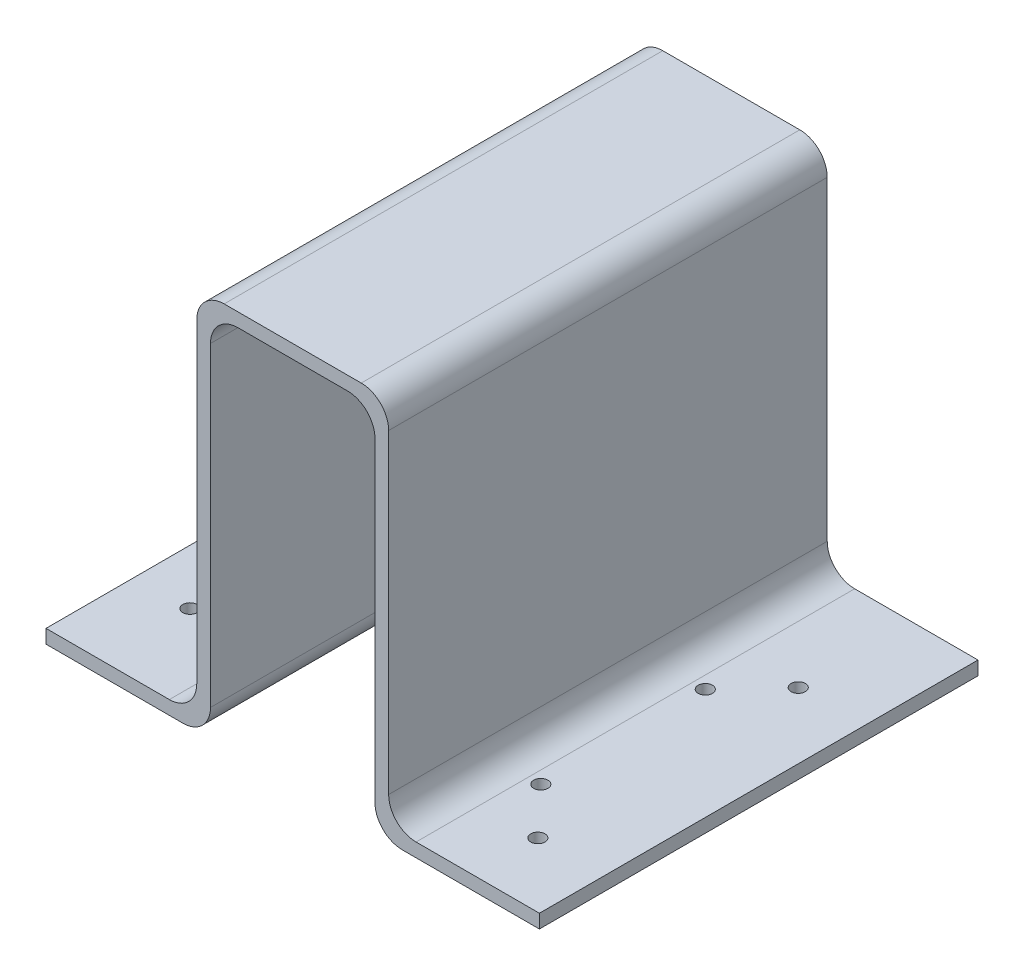
ISO-10303-21;
HEADER;
FILE_DESCRIPTION(('STEP AP214'),'2;1');
FILE_NAME('part.step','',(''),(''),'','','');
FILE_SCHEMA(('AUTOMOTIVE_DESIGN { 1 0 10303 214 1 1 1 1 }'));
ENDSEC;
DATA;
#1=APPLICATION_CONTEXT('core data for automotive mechanical design processes');
#2=APPLICATION_PROTOCOL_DEFINITION('international standard','automotive_design',2000,#1);
#3=PRODUCT_CONTEXT('',#1,'mechanical');
#4=PRODUCT('Part','Part','',(#3));
#5=PRODUCT_RELATED_PRODUCT_CATEGORY('part','',(#4));
#6=PRODUCT_DEFINITION_FORMATION('','',#4);
#7=PRODUCT_DEFINITION_CONTEXT('part definition',#1,'design');
#8=PRODUCT_DEFINITION('design','',#6,#7);
#9=PRODUCT_DEFINITION_SHAPE('','',#8);
#10=(LENGTH_UNIT() NAMED_UNIT(*) SI_UNIT(.MILLI.,.METRE.));
#11=(NAMED_UNIT(*) PLANE_ANGLE_UNIT() SI_UNIT($,.RADIAN.));
#12=(NAMED_UNIT(*) SI_UNIT($,.STERADIAN.) SOLID_ANGLE_UNIT());
#13=UNCERTAINTY_MEASURE_WITH_UNIT(LENGTH_MEASURE(1.E-05),#10,'distance_accuracy_value','');
#14=(GEOMETRIC_REPRESENTATION_CONTEXT(3) GLOBAL_UNCERTAINTY_ASSIGNED_CONTEXT((#13)) GLOBAL_UNIT_ASSIGNED_CONTEXT((#10,
#11,#12)) REPRESENTATION_CONTEXT('',''));
#15=CARTESIAN_POINT('',(0.,0.,0.));
#16=DIRECTION('',(0.,0.,1.));
#17=DIRECTION('',(1.,0.,0.));
#18=AXIS2_PLACEMENT_3D('',#15,#16,#17);
#19=CARTESIAN_POINT('',(0.,0.,203.2));
#20=DIRECTION('',(1.,0.,0.));
#21=DIRECTION('',(0.,0.,-1.));
#22=AXIS2_PLACEMENT_3D('',#19,#20,#21);
#23=PLANE('',#22);
#24=DIRECTION('',(0.,-1.,0.));
#25=VECTOR('',#24,1.);
#26=CARTESIAN_POINT('',(0.,0.,0.));
#27=LINE('',#26,#25);
#28=CARTESIAN_POINT('',(0.,6.35,0.));
#29=VERTEX_POINT('',#28);
#30=CARTESIAN_POINT('',(0.,0.,0.));
#31=VERTEX_POINT('',#30);
#32=EDGE_CURVE('E171',#29,#31,#27,.T.);
#33=ORIENTED_EDGE('',*,*,#32,.T.);
#34=DIRECTION('',(0.,0.,-1.));
#35=VECTOR('',#34,1.);
#36=CARTESIAN_POINT('',(0.,0.,203.2));
#37=LINE('',#36,#35);
#38=CARTESIAN_POINT('',(0.,0.,203.2));
#39=VERTEX_POINT('',#38);
#40=EDGE_CURVE('E11',#39,#31,#37,.T.);
#41=ORIENTED_EDGE('',*,*,#40,.F.);
#42=DIRECTION('',(0.,-1.,0.));
#43=VECTOR('',#42,1.);
#44=CARTESIAN_POINT('',(0.,0.,203.2));
#45=LINE('',#44,#43);
#46=CARTESIAN_POINT('',(0.,6.35,203.2));
#47=VERTEX_POINT('',#46);
#48=EDGE_CURVE('E228',#47,#39,#45,.T.);
#49=ORIENTED_EDGE('',*,*,#48,.F.);
#50=DIRECTION('',(0.,0.,-1.));
#51=VECTOR('',#50,1.);
#52=CARTESIAN_POINT('',(0.,6.35,203.2));
#53=LINE('',#52,#51);
#54=EDGE_CURVE('E184',#47,#29,#53,.T.);
#55=ORIENTED_EDGE('',*,*,#54,.T.);
#56=EDGE_LOOP('',(#33,#41,#49,#55));
#57=FACE_BOUND('',#56,.T.);
#58=ADVANCED_FACE('F31',(#57),#23,.F.);
#59=CARTESIAN_POINT('',(0.,0.,203.2));
#60=DIRECTION('',(0.,1.,0.));
#61=DIRECTION('',(0.,0.,1.));
#62=AXIS2_PLACEMENT_3D('',#59,#60,#61);
#63=PLANE('',#62);
#64=CARTESIAN_POINT('',(50.8,0.,139.7));
#65=DIRECTION('',(0.,1.,0.));
#66=DIRECTION('',(0.,0.,1.));
#67=AXIS2_PLACEMENT_3D('',#64,#65,#66);
#68=CIRCLE('',#67,3.302);
#69=CARTESIAN_POINT('',(50.8,0.,143.002));
#70=VERTEX_POINT('',#69);
#71=EDGE_CURVE('E616',#70,#70,#68,.T.);
#72=ORIENTED_EDGE('',*,*,#71,.T.);
#73=EDGE_LOOP('',(#72));
#74=FACE_BOUND('',#73,.T.);
#75=CARTESIAN_POINT('',(25.4,0.,161.925));
#76=DIRECTION('',(0.,1.,0.));
#77=DIRECTION('',(0.,0.,1.));
#78=AXIS2_PLACEMENT_3D('',#75,#76,#77);
#79=CIRCLE('',#78,3.302);
#80=CARTESIAN_POINT('',(25.4,0.,165.227));
#81=VERTEX_POINT('',#80);
#82=EDGE_CURVE('E621',#81,#81,#79,.T.);
#83=ORIENTED_EDGE('',*,*,#82,.T.);
#84=EDGE_LOOP('',(#83));
#85=FACE_BOUND('',#84,.T.);
#86=CARTESIAN_POINT('',(50.8,0.,63.5));
#87=DIRECTION('',(0.,1.,0.));
#88=DIRECTION('',(0.,0.,1.));
#89=AXIS2_PLACEMENT_3D('',#86,#87,#88);
#90=CIRCLE('',#89,3.302);
#91=CARTESIAN_POINT('',(50.8,0.,66.802));
#92=VERTEX_POINT('',#91);
#93=EDGE_CURVE('E627',#92,#92,#90,.T.);
#94=ORIENTED_EDGE('',*,*,#93,.T.);
#95=EDGE_LOOP('',(#94));
#96=FACE_BOUND('',#95,.T.);
#97=CARTESIAN_POINT('',(25.4,0.,41.275));
#98=DIRECTION('',(0.,1.,0.));
#99=DIRECTION('',(0.,0.,1.));
#100=AXIS2_PLACEMENT_3D('',#97,#98,#99);
#101=CIRCLE('',#100,3.302);
#102=CARTESIAN_POINT('',(25.4,0.,44.577));
#103=VERTEX_POINT('',#102);
#104=EDGE_CURVE('E185',#103,#103,#101,.T.);
#105=ORIENTED_EDGE('',*,*,#104,.T.);
#106=EDGE_LOOP('',(#105));
#107=FACE_BOUND('',#106,.T.);
#108=DIRECTION('',(1.,0.,0.));
#109=VECTOR('',#108,1.);
#110=CARTESIAN_POINT('',(0.,0.,0.));
#111=LINE('',#110,#109);
#112=CARTESIAN_POINT('',(63.4999999999999,0.,0.));
#113=VERTEX_POINT('',#112);
#114=EDGE_CURVE('E167',#31,#113,#111,.T.);
#115=ORIENTED_EDGE('',*,*,#114,.T.);
#116=DIRECTION('',(0.,0.,-1.));
#117=VECTOR('',#116,1.);
#118=CARTESIAN_POINT('',(63.4999999999999,0.,203.2));
#119=LINE('',#118,#117);
#120=CARTESIAN_POINT('',(63.4999999999999,0.,203.2));
#121=VERTEX_POINT('',#120);
#122=EDGE_CURVE('E38',#121,#113,#119,.T.);
#123=ORIENTED_EDGE('',*,*,#122,.F.);
#124=DIRECTION('',(1.,0.,0.));
#125=VECTOR('',#124,1.);
#126=CARTESIAN_POINT('',(0.,0.,203.2));
#127=LINE('',#126,#125);
#128=EDGE_CURVE('E180',#39,#121,#127,.T.);
#129=ORIENTED_EDGE('',*,*,#128,.F.);
#130=ORIENTED_EDGE('',*,*,#40,.T.);
#131=EDGE_LOOP('',(#115,#123,#129,#130));
#132=FACE_BOUND('',#131,.T.);
#133=ADVANCED_FACE('F179',(#74,#85,#96,#107,#132),#63,.F.);
#134=CARTESIAN_POINT('',(63.5,12.7,203.2));
#135=DIRECTION('',(0.,0.,-1.));
#136=DIRECTION('',(-1.,0.,0.));
#137=AXIS2_PLACEMENT_3D('',#134,#135,#136);
#138=CYLINDRICAL_SURFACE('',#137,12.7);
#139=CARTESIAN_POINT('',(63.5,12.7,0.));
#140=DIRECTION('',(0.,0.,1.));
#141=DIRECTION('',(1.,0.,0.));
#142=AXIS2_PLACEMENT_3D('',#139,#140,#141);
#143=CIRCLE('',#142,12.7);
#144=CARTESIAN_POINT('',(76.2,12.7000000000001,0.));
#145=VERTEX_POINT('',#144);
#146=EDGE_CURVE('E173',#113,#145,#143,.T.);
#147=ORIENTED_EDGE('',*,*,#146,.T.);
#148=DIRECTION('',(0.,0.,-1.));
#149=VECTOR('',#148,1.);
#150=CARTESIAN_POINT('',(76.2,12.7000000000001,203.2));
#151=LINE('',#150,#149);
#152=CARTESIAN_POINT('',(76.2,12.7000000000001,203.2));
#153=VERTEX_POINT('',#152);
#154=EDGE_CURVE('E314',#153,#145,#151,.T.);
#155=ORIENTED_EDGE('',*,*,#154,.F.);
#156=CARTESIAN_POINT('',(63.5,12.7,203.2));
#157=DIRECTION('',(0.,0.,1.));
#158=DIRECTION('',(1.,0.,0.));
#159=AXIS2_PLACEMENT_3D('',#156,#157,#158);
#160=CIRCLE('',#159,12.7);
#161=EDGE_CURVE('E231',#121,#153,#160,.T.);
#162=ORIENTED_EDGE('',*,*,#161,.F.);
#163=ORIENTED_EDGE('',*,*,#122,.T.);
#164=EDGE_LOOP('',(#147,#155,#162,#163));
#165=FACE_BOUND('',#164,.T.);
#166=ADVANCED_FACE('F318',(#165),#138,.T.);
#167=CARTESIAN_POINT('',(76.2,158.75,203.2));
#168=DIRECTION('',(-1.,0.,0.));
#169=DIRECTION('',(0.,-1.,0.));
#170=AXIS2_PLACEMENT_3D('',#167,#168,#169);
#171=PLANE('',#170);
#172=DIRECTION('',(0.,1.,0.));
#173=VECTOR('',#172,1.);
#174=CARTESIAN_POINT('',(76.2,158.75,0.));
#175=LINE('',#174,#173);
#176=CARTESIAN_POINT('',(76.2,158.75,0.));
#177=VERTEX_POINT('',#176);
#178=EDGE_CURVE('E193',#145,#177,#175,.T.);
#179=ORIENTED_EDGE('',*,*,#178,.T.);
#180=DIRECTION('',(0.,0.,-1.));
#181=VECTOR('',#180,1.);
#182=CARTESIAN_POINT('',(76.2,158.75,203.2));
#183=LINE('',#182,#181);
#184=CARTESIAN_POINT('',(76.2,158.75,203.2));
#185=VERTEX_POINT('',#184);
#186=EDGE_CURVE('E311',#185,#177,#183,.T.);
#187=ORIENTED_EDGE('',*,*,#186,.F.);
#188=DIRECTION('',(0.,1.,0.));
#189=VECTOR('',#188,1.);
#190=CARTESIAN_POINT('',(76.2,158.75,203.2));
#191=LINE('',#190,#189);
#192=EDGE_CURVE('E233',#153,#185,#191,.T.);
#193=ORIENTED_EDGE('',*,*,#192,.F.);
#194=ORIENTED_EDGE('',*,*,#154,.T.);
#195=EDGE_LOOP('',(#179,#187,#193,#194));
#196=FACE_BOUND('',#195,.T.);
#197=ADVANCED_FACE('F326',(#196),#171,.F.);
#198=CARTESIAN_POINT('',(88.9,158.75,203.2));
#199=DIRECTION('',(0.,0.,-1.));
#200=DIRECTION('',(-1.,0.,0.));
#201=AXIS2_PLACEMENT_3D('',#198,#199,#200);
#202=CYLINDRICAL_SURFACE('',#201,12.7);
#203=CARTESIAN_POINT('',(88.9,158.75,0.));
#204=DIRECTION('',(0.,0.,-1.));
#205=DIRECTION('',(1.,0.,0.));
#206=AXIS2_PLACEMENT_3D('',#203,#204,#205);
#207=CIRCLE('',#206,12.7);
#208=CARTESIAN_POINT('',(88.9000000000001,171.45,0.));
#209=VERTEX_POINT('',#208);
#210=EDGE_CURVE('E195',#177,#209,#207,.T.);
#211=ORIENTED_EDGE('',*,*,#210,.T.);
#212=DIRECTION('',(0.,0.,-1.));
#213=VECTOR('',#212,1.);
#214=CARTESIAN_POINT('',(88.9000000000001,171.45,203.2));
#215=LINE('',#214,#213);
#216=CARTESIAN_POINT('',(88.9000000000001,171.45,203.2));
#217=VERTEX_POINT('',#216);
#218=EDGE_CURVE('E308',#217,#209,#215,.T.);
#219=ORIENTED_EDGE('',*,*,#218,.F.);
#220=CARTESIAN_POINT('',(88.9,158.75,203.2));
#221=DIRECTION('',(0.,0.,-1.));
#222=DIRECTION('',(1.,0.,0.));
#223=AXIS2_PLACEMENT_3D('',#220,#221,#222);
#224=CIRCLE('',#223,12.7);
#225=EDGE_CURVE('E235',#185,#217,#224,.T.);
#226=ORIENTED_EDGE('',*,*,#225,.F.);
#227=ORIENTED_EDGE('',*,*,#186,.T.);
#228=EDGE_LOOP('',(#211,#219,#226,#227));
#229=FACE_BOUND('',#228,.T.);
#230=ADVANCED_FACE('F329',(#229),#202,.F.);
#231=CARTESIAN_POINT('',(139.7,171.45,203.2));
#232=DIRECTION('',(0.,1.,0.));
#233=DIRECTION('',(-1.,0.,0.));
#234=AXIS2_PLACEMENT_3D('',#231,#232,#233);
#235=PLANE('',#234);
#236=DIRECTION('',(1.,0.,0.));
#237=VECTOR('',#236,1.);
#238=CARTESIAN_POINT('',(139.7,171.45,0.));
#239=LINE('',#238,#237);
#240=CARTESIAN_POINT('',(139.7,171.45,0.));
#241=VERTEX_POINT('',#240);
#242=EDGE_CURVE('E197',#209,#241,#239,.T.);
#243=ORIENTED_EDGE('',*,*,#242,.T.);
#244=DIRECTION('',(0.,0.,-1.));
#245=VECTOR('',#244,1.);
#246=CARTESIAN_POINT('',(139.7,171.45,203.2));
#247=LINE('',#246,#245);
#248=CARTESIAN_POINT('',(139.7,171.45,203.2));
#249=VERTEX_POINT('',#248);
#250=EDGE_CURVE('E305',#249,#241,#247,.T.);
#251=ORIENTED_EDGE('',*,*,#250,.F.);
#252=DIRECTION('',(1.,0.,0.));
#253=VECTOR('',#252,1.);
#254=CARTESIAN_POINT('',(139.7,171.45,203.2));
#255=LINE('',#254,#253);
#256=EDGE_CURVE('E237',#217,#249,#255,.T.);
#257=ORIENTED_EDGE('',*,*,#256,.F.);
#258=ORIENTED_EDGE('',*,*,#218,.T.);
#259=EDGE_LOOP('',(#243,#251,#257,#258));
#260=FACE_BOUND('',#259,.T.);
#261=ADVANCED_FACE('F334',(#260),#235,.F.);
#262=CARTESIAN_POINT('',(139.7,158.75,203.2));
#263=DIRECTION('',(0.,0.,-1.));
#264=DIRECTION('',(-1.,0.,0.));
#265=AXIS2_PLACEMENT_3D('',#262,#263,#264);
#266=CYLINDRICAL_SURFACE('',#265,12.7);
#267=CARTESIAN_POINT('',(139.7,158.75,0.));
#268=DIRECTION('',(0.,0.,-1.));
#269=DIRECTION('',(-1.,0.,0.));
#270=AXIS2_PLACEMENT_3D('',#267,#268,#269);
#271=CIRCLE('',#270,12.7);
#272=CARTESIAN_POINT('',(152.4,158.75,0.));
#273=VERTEX_POINT('',#272);
#274=EDGE_CURVE('E199',#241,#273,#271,.T.);
#275=ORIENTED_EDGE('',*,*,#274,.T.);
#276=DIRECTION('',(0.,0.,-1.));
#277=VECTOR('',#276,1.);
#278=CARTESIAN_POINT('',(152.4,158.75,203.2));
#279=LINE('',#278,#277);
#280=CARTESIAN_POINT('',(152.4,158.75,203.2));
#281=VERTEX_POINT('',#280);
#282=EDGE_CURVE('E302',#281,#273,#279,.T.);
#283=ORIENTED_EDGE('',*,*,#282,.F.);
#284=CARTESIAN_POINT('',(139.7,158.75,203.2));
#285=DIRECTION('',(0.,0.,-1.));
#286=DIRECTION('',(-1.,0.,0.));
#287=AXIS2_PLACEMENT_3D('',#284,#285,#286);
#288=CIRCLE('',#287,12.7);
#289=EDGE_CURVE('E239',#249,#281,#288,.T.);
#290=ORIENTED_EDGE('',*,*,#289,.F.);
#291=ORIENTED_EDGE('',*,*,#250,.T.);
#292=EDGE_LOOP('',(#275,#283,#290,#291));
#293=FACE_BOUND('',#292,.T.);
#294=ADVANCED_FACE('F340',(#293),#266,.F.);
#295=CARTESIAN_POINT('',(152.4,12.7000000000001,203.2));
#296=DIRECTION('',(1.,0.,0.));
#297=DIRECTION('',(0.,0.,-1.));
#298=AXIS2_PLACEMENT_3D('',#295,#296,#297);
#299=PLANE('',#298);
#300=DIRECTION('',(0.,-1.,0.));
#301=VECTOR('',#300,1.);
#302=CARTESIAN_POINT('',(152.4,12.7000000000001,0.));
#303=LINE('',#302,#301);
#304=CARTESIAN_POINT('',(152.4,12.7000000000001,0.));
#305=VERTEX_POINT('',#304);
#306=EDGE_CURVE('E201',#273,#305,#303,.T.);
#307=ORIENTED_EDGE('',*,*,#306,.T.);
#308=DIRECTION('',(0.,0.,-1.));
#309=VECTOR('',#308,1.);
#310=CARTESIAN_POINT('',(152.4,12.7000000000001,203.2));
#311=LINE('',#310,#309);
#312=CARTESIAN_POINT('',(152.4,12.7000000000001,203.2));
#313=VERTEX_POINT('',#312);
#314=EDGE_CURVE('E299',#313,#305,#311,.T.);
#315=ORIENTED_EDGE('',*,*,#314,.F.);
#316=DIRECTION('',(0.,-1.,0.));
#317=VECTOR('',#316,1.);
#318=CARTESIAN_POINT('',(152.4,12.7000000000001,203.2));
#319=LINE('',#318,#317);
#320=EDGE_CURVE('E241',#281,#313,#319,.T.);
#321=ORIENTED_EDGE('',*,*,#320,.F.);
#322=ORIENTED_EDGE('',*,*,#282,.T.);
#323=EDGE_LOOP('',(#307,#315,#321,#322));
#324=FACE_BOUND('',#323,.T.);
#325=ADVANCED_FACE('F344',(#324),#299,.F.);
#326=CARTESIAN_POINT('',(165.1,12.7,203.2));
#327=DIRECTION('',(0.,0.,-1.));
#328=DIRECTION('',(-1.,0.,0.));
#329=AXIS2_PLACEMENT_3D('',#326,#327,#328);
#330=CYLINDRICAL_SURFACE('',#329,12.7);
#331=CARTESIAN_POINT('',(165.1,12.7,0.));
#332=DIRECTION('',(0.,0.,1.));
#333=DIRECTION('',(-1.,0.,0.));
#334=AXIS2_PLACEMENT_3D('',#331,#332,#333);
#335=CIRCLE('',#334,12.7);
#336=CARTESIAN_POINT('',(165.1,0.,0.));
#337=VERTEX_POINT('',#336);
#338=EDGE_CURVE('E203',#305,#337,#335,.T.);
#339=ORIENTED_EDGE('',*,*,#338,.T.);
#340=DIRECTION('',(0.,0.,-1.));
#341=VECTOR('',#340,1.);
#342=CARTESIAN_POINT('',(165.1,0.,203.2));
#343=LINE('',#342,#341);
#344=CARTESIAN_POINT('',(165.1,0.,203.2));
#345=VERTEX_POINT('',#344);
#346=EDGE_CURVE('E296',#345,#337,#343,.T.);
#347=ORIENTED_EDGE('',*,*,#346,.F.);
#348=CARTESIAN_POINT('',(165.1,12.7,203.2));
#349=DIRECTION('',(0.,0.,1.));
#350=DIRECTION('',(-1.,0.,0.));
#351=AXIS2_PLACEMENT_3D('',#348,#349,#350);
#352=CIRCLE('',#351,12.7);
#353=EDGE_CURVE('E243',#313,#345,#352,.T.);
#354=ORIENTED_EDGE('',*,*,#353,.F.);
#355=ORIENTED_EDGE('',*,*,#314,.T.);
#356=EDGE_LOOP('',(#339,#347,#354,#355));
#357=FACE_BOUND('',#356,.T.);
#358=ADVANCED_FACE('F349',(#357),#330,.T.);
#359=CARTESIAN_POINT('',(228.6,0.,203.2));
#360=DIRECTION('',(0.,1.,0.));
#361=DIRECTION('',(-1.,0.,0.));
#362=AXIS2_PLACEMENT_3D('',#359,#360,#361);
#363=PLANE('',#362);
#364=CARTESIAN_POINT('',(198.017767449923,0.,173.356336248613));
#365=DIRECTION('',(0.,1.,0.));
#366=DIRECTION('',(-1.,0.,0.));
#367=AXIS2_PLACEMENT_3D('',#364,#365,#366);
#368=CIRCLE('',#367,3.30200000000001);
#369=CARTESIAN_POINT('',(194.715767449923,0.,173.356336248613));
#370=VERTEX_POINT('',#369);
#371=EDGE_CURVE('E588',#370,#370,#368,.T.);
#372=ORIENTED_EDGE('',*,*,#371,.T.);
#373=EDGE_LOOP('',(#372));
#374=FACE_BOUND('',#373,.T.);
#375=CARTESIAN_POINT('',(198.017767449923,0.,52.7063362486132));
#376=DIRECTION('',(0.,1.,0.));
#377=DIRECTION('',(-1.,0.,0.));
#378=AXIS2_PLACEMENT_3D('',#375,#376,#377);
#379=CIRCLE('',#378,3.30200000000001);
#380=CARTESIAN_POINT('',(194.715767449923,0.,52.7063362486132));
#381=VERTEX_POINT('',#380);
#382=EDGE_CURVE('E598',#381,#381,#379,.T.);
#383=ORIENTED_EDGE('',*,*,#382,.T.);
#384=EDGE_LOOP('',(#383));
#385=FACE_BOUND('',#384,.T.);
#386=CARTESIAN_POINT('',(177.183969253211,0.,151.131336248613));
#387=DIRECTION('',(0.,1.,0.));
#388=DIRECTION('',(-1.,0.,0.));
#389=AXIS2_PLACEMENT_3D('',#386,#387,#388);
#390=CIRCLE('',#389,3.30200000000001);
#391=CARTESIAN_POINT('',(173.881969253211,0.,151.131336248613));
#392=VERTEX_POINT('',#391);
#393=EDGE_CURVE('E604',#392,#392,#390,.T.);
#394=ORIENTED_EDGE('',*,*,#393,.T.);
#395=EDGE_LOOP('',(#394));
#396=FACE_BOUND('',#395,.T.);
#397=CARTESIAN_POINT('',(177.183969253211,0.,74.9313362486132));
#398=DIRECTION('',(0.,1.,0.));
#399=DIRECTION('',(-1.,0.,0.));
#400=AXIS2_PLACEMENT_3D('',#397,#398,#399);
#401=CIRCLE('',#400,3.30200000000001);
#402=CARTESIAN_POINT('',(173.881969253211,0.,74.9313362486132));
#403=VERTEX_POINT('',#402);
#404=EDGE_CURVE('E610',#403,#403,#401,.T.);
#405=ORIENTED_EDGE('',*,*,#404,.T.);
#406=EDGE_LOOP('',(#405));
#407=FACE_BOUND('',#406,.T.);
#408=DIRECTION('',(1.,0.,0.));
#409=VECTOR('',#408,1.);
#410=CARTESIAN_POINT('',(228.6,0.,0.));
#411=LINE('',#410,#409);
#412=CARTESIAN_POINT('',(228.6,0.,0.));
#413=VERTEX_POINT('',#412);
#414=EDGE_CURVE('E205',#337,#413,#411,.T.);
#415=ORIENTED_EDGE('',*,*,#414,.T.);
#416=DIRECTION('',(0.,0.,-1.));
#417=VECTOR('',#416,1.);
#418=CARTESIAN_POINT('',(228.6,0.,203.2));
#419=LINE('',#418,#417);
#420=CARTESIAN_POINT('',(228.6,0.,203.2));
#421=VERTEX_POINT('',#420);
#422=EDGE_CURVE('E293',#421,#413,#419,.T.);
#423=ORIENTED_EDGE('',*,*,#422,.F.);
#424=DIRECTION('',(1.,0.,0.));
#425=VECTOR('',#424,1.);
#426=CARTESIAN_POINT('',(228.6,0.,203.2));
#427=LINE('',#426,#425);
#428=EDGE_CURVE('E245',#345,#421,#427,.T.);
#429=ORIENTED_EDGE('',*,*,#428,.F.);
#430=ORIENTED_EDGE('',*,*,#346,.T.);
#431=EDGE_LOOP('',(#415,#423,#429,#430));
#432=FACE_BOUND('',#431,.T.);
#433=ADVANCED_FACE('F355',(#374,#385,#396,#407,#432),#363,.F.);
#434=CARTESIAN_POINT('',(228.6,0.133258460616945,203.2));
#435=DIRECTION('',(-1.,0.,0.));
#436=DIRECTION('',(0.,0.,1.));
#437=AXIS2_PLACEMENT_3D('',#434,#435,#436);
#438=PLANE('',#437);
#439=DIRECTION('',(0.,1.,0.));
#440=VECTOR('',#439,1.);
#441=CARTESIAN_POINT('',(228.6,0.133258460616945,0.));
#442=LINE('',#441,#440);
#443=CARTESIAN_POINT('',(228.6,6.35,0.));
#444=VERTEX_POINT('',#443);
#445=EDGE_CURVE('E208',#413,#444,#442,.T.);
#446=ORIENTED_EDGE('',*,*,#445,.T.);
#447=DIRECTION('',(0.,0.,-1.));
#448=VECTOR('',#447,1.);
#449=CARTESIAN_POINT('',(228.6,6.35,203.2));
#450=LINE('',#449,#448);
#451=CARTESIAN_POINT('',(228.6,6.35,203.2));
#452=VERTEX_POINT('',#451);
#453=EDGE_CURVE('E290',#452,#444,#450,.T.);
#454=ORIENTED_EDGE('',*,*,#453,.F.);
#455=DIRECTION('',(0.,1.,0.));
#456=VECTOR('',#455,1.);
#457=CARTESIAN_POINT('',(228.6,0.,203.2));
#458=LINE('',#457,#456);
#459=EDGE_CURVE('E247',#421,#452,#458,.T.);
#460=ORIENTED_EDGE('',*,*,#459,.F.);
#461=ORIENTED_EDGE('',*,*,#422,.T.);
#462=EDGE_LOOP('',(#446,#454,#460,#461));
#463=FACE_BOUND('',#462,.T.);
#464=ADVANCED_FACE('F358',(#463),#438,.F.);
#465=CARTESIAN_POINT('',(228.6,6.35,203.2));
#466=DIRECTION('',(0.,-1.,0.));
#467=DIRECTION('',(1.,0.,0.));
#468=AXIS2_PLACEMENT_3D('',#465,#466,#467);
#469=PLANE('',#468);
#470=CARTESIAN_POINT('',(198.017767449923,6.35,173.356336248613));
#471=DIRECTION('',(0.,1.,0.));
#472=DIRECTION('',(-1.,0.,0.));
#473=AXIS2_PLACEMENT_3D('',#470,#471,#472);
#474=CIRCLE('',#473,3.30200000000001);
#475=CARTESIAN_POINT('',(194.715767449923,6.34999999999999,173.356336248613));
#476=VERTEX_POINT('',#475);
#477=EDGE_CURVE('E591',#476,#476,#474,.T.);
#478=ORIENTED_EDGE('',*,*,#477,.F.);
#479=EDGE_LOOP('',(#478));
#480=FACE_BOUND('',#479,.T.);
#481=CARTESIAN_POINT('',(198.017767449923,6.35,52.7063362486132));
#482=DIRECTION('',(0.,1.,0.));
#483=DIRECTION('',(-1.,0.,0.));
#484=AXIS2_PLACEMENT_3D('',#481,#482,#483);
#485=CIRCLE('',#484,3.30200000000001);
#486=CARTESIAN_POINT('',(194.715767449923,6.34999999999999,52.7063362486132));
#487=VERTEX_POINT('',#486);
#488=EDGE_CURVE('E593',#487,#487,#485,.T.);
#489=ORIENTED_EDGE('',*,*,#488,.F.);
#490=EDGE_LOOP('',(#489));
#491=FACE_BOUND('',#490,.T.);
#492=CARTESIAN_POINT('',(177.183969253211,6.34999999999999,151.131336248613));
#493=DIRECTION('',(0.,1.,0.));
#494=DIRECTION('',(-1.,0.,0.));
#495=AXIS2_PLACEMENT_3D('',#492,#493,#494);
#496=CIRCLE('',#495,3.30200000000001);
#497=CARTESIAN_POINT('',(173.881969253211,6.34999999999999,151.131336248613));
#498=VERTEX_POINT('',#497);
#499=EDGE_CURVE('E601',#498,#498,#496,.T.);
#500=ORIENTED_EDGE('',*,*,#499,.F.);
#501=EDGE_LOOP('',(#500));
#502=FACE_BOUND('',#501,.T.);
#503=CARTESIAN_POINT('',(177.183969253211,6.34999999999999,74.9313362486132));
#504=DIRECTION('',(0.,1.,0.));
#505=DIRECTION('',(-1.,0.,0.));
#506=AXIS2_PLACEMENT_3D('',#503,#504,#505);
#507=CIRCLE('',#506,3.30200000000001);
#508=CARTESIAN_POINT('',(173.881969253211,6.34999999999999,74.9313362486132));
#509=VERTEX_POINT('',#508);
#510=EDGE_CURVE('E607',#509,#509,#507,.T.);
#511=ORIENTED_EDGE('',*,*,#510,.F.);
#512=EDGE_LOOP('',(#511));
#513=FACE_BOUND('',#512,.T.);
#514=DIRECTION('',(-1.,0.,0.));
#515=VECTOR('',#514,1.);
#516=CARTESIAN_POINT('',(228.6,6.35,0.));
#517=LINE('',#516,#515);
#518=CARTESIAN_POINT('',(171.45,6.34999999999999,0.));
#519=VERTEX_POINT('',#518);
#520=EDGE_CURVE('E210',#444,#519,#517,.T.);
#521=ORIENTED_EDGE('',*,*,#520,.T.);
#522=DIRECTION('',(0.,0.,-1.));
#523=VECTOR('',#522,1.);
#524=CARTESIAN_POINT('',(171.45,6.34999999999999,203.2));
#525=LINE('',#524,#523);
#526=CARTESIAN_POINT('',(171.45,6.34999999999999,203.2));
#527=VERTEX_POINT('',#526);
#528=EDGE_CURVE('E287',#527,#519,#525,.T.);
#529=ORIENTED_EDGE('',*,*,#528,.F.);
#530=DIRECTION('',(-1.,0.,0.));
#531=VECTOR('',#530,1.);
#532=CARTESIAN_POINT('',(228.6,6.35,203.2));
#533=LINE('',#532,#531);
#534=EDGE_CURVE('E249',#452,#527,#533,.T.);
#535=ORIENTED_EDGE('',*,*,#534,.F.);
#536=ORIENTED_EDGE('',*,*,#453,.T.);
#537=EDGE_LOOP('',(#521,#529,#535,#536));
#538=FACE_BOUND('',#537,.T.);
#539=ADVANCED_FACE('F363',(#480,#491,#502,#513,#538),#469,.F.);
#540=CARTESIAN_POINT('',(171.45,19.05,203.2));
#541=DIRECTION('',(0.,0.,-1.));
#542=DIRECTION('',(-1.,0.,0.));
#543=AXIS2_PLACEMENT_3D('',#540,#541,#542);
#544=CYLINDRICAL_SURFACE('',#543,12.7);
#545=CARTESIAN_POINT('',(171.45,19.05,0.));
#546=DIRECTION('',(0.,0.,-1.));
#547=DIRECTION('',(1.,0.,0.));
#548=AXIS2_PLACEMENT_3D('',#545,#546,#547);
#549=CIRCLE('',#548,12.7);
#550=CARTESIAN_POINT('',(158.75,19.05,0.));
#551=VERTEX_POINT('',#550);
#552=EDGE_CURVE('E212',#519,#551,#549,.T.);
#553=ORIENTED_EDGE('',*,*,#552,.T.);
#554=DIRECTION('',(0.,0.,-1.));
#555=VECTOR('',#554,1.);
#556=CARTESIAN_POINT('',(158.75,19.05,203.2));
#557=LINE('',#556,#555);
#558=CARTESIAN_POINT('',(158.75,19.05,203.2));
#559=VERTEX_POINT('',#558);
#560=EDGE_CURVE('E284',#559,#551,#557,.T.);
#561=ORIENTED_EDGE('',*,*,#560,.F.);
#562=CARTESIAN_POINT('',(171.45,19.05,203.2));
#563=DIRECTION('',(0.,0.,-1.));
#564=DIRECTION('',(1.,0.,0.));
#565=AXIS2_PLACEMENT_3D('',#562,#563,#564);
#566=CIRCLE('',#565,12.7);
#567=EDGE_CURVE('E251',#527,#559,#566,.T.);
#568=ORIENTED_EDGE('',*,*,#567,.F.);
#569=ORIENTED_EDGE('',*,*,#528,.T.);
#570=EDGE_LOOP('',(#553,#561,#568,#569));
#571=FACE_BOUND('',#570,.T.);
#572=ADVANCED_FACE('F369',(#571),#544,.F.);
#573=CARTESIAN_POINT('',(158.75,165.1,203.2));
#574=DIRECTION('',(-1.,0.,0.));
#575=DIRECTION('',(0.,-1.,0.));
#576=AXIS2_PLACEMENT_3D('',#573,#574,#575);
#577=PLANE('',#576);
#578=DIRECTION('',(0.,1.,0.));
#579=VECTOR('',#578,1.);
#580=CARTESIAN_POINT('',(158.75,165.1,0.));
#581=LINE('',#580,#579);
#582=CARTESIAN_POINT('',(158.75,165.1,0.));
#583=VERTEX_POINT('',#582);
#584=EDGE_CURVE('E214',#551,#583,#581,.T.);
#585=ORIENTED_EDGE('',*,*,#584,.T.);
#586=DIRECTION('',(0.,0.,-1.));
#587=VECTOR('',#586,1.);
#588=CARTESIAN_POINT('',(158.75,165.1,203.2));
#589=LINE('',#588,#587);
#590=CARTESIAN_POINT('',(158.75,165.1,203.2));
#591=VERTEX_POINT('',#590);
#592=EDGE_CURVE('E281',#591,#583,#589,.T.);
#593=ORIENTED_EDGE('',*,*,#592,.F.);
#594=DIRECTION('',(0.,1.,0.));
#595=VECTOR('',#594,1.);
#596=CARTESIAN_POINT('',(158.75,165.1,203.2));
#597=LINE('',#596,#595);
#598=EDGE_CURVE('E253',#559,#591,#597,.T.);
#599=ORIENTED_EDGE('',*,*,#598,.F.);
#600=ORIENTED_EDGE('',*,*,#560,.T.);
#601=EDGE_LOOP('',(#585,#593,#599,#600));
#602=FACE_BOUND('',#601,.T.);
#603=ADVANCED_FACE('F373',(#602),#577,.F.);
#604=CARTESIAN_POINT('',(146.05,165.1,203.2));
#605=DIRECTION('',(0.,0.,-1.));
#606=DIRECTION('',(-1.,0.,0.));
#607=AXIS2_PLACEMENT_3D('',#604,#605,#606);
#608=CYLINDRICAL_SURFACE('',#607,12.7);
#609=CARTESIAN_POINT('',(146.05,165.1,0.));
#610=DIRECTION('',(0.,0.,1.));
#611=DIRECTION('',(1.,0.,0.));
#612=AXIS2_PLACEMENT_3D('',#609,#610,#611);
#613=CIRCLE('',#612,12.7);
#614=CARTESIAN_POINT('',(146.05,177.8,0.));
#615=VERTEX_POINT('',#614);
#616=EDGE_CURVE('E216',#583,#615,#613,.T.);
#617=ORIENTED_EDGE('',*,*,#616,.T.);
#618=DIRECTION('',(0.,0.,-1.));
#619=VECTOR('',#618,1.);
#620=CARTESIAN_POINT('',(146.05,177.8,203.2));
#621=LINE('',#620,#619);
#622=CARTESIAN_POINT('',(146.05,177.8,203.2));
#623=VERTEX_POINT('',#622);
#624=EDGE_CURVE('E278',#623,#615,#621,.T.);
#625=ORIENTED_EDGE('',*,*,#624,.F.);
#626=CARTESIAN_POINT('',(146.05,165.1,203.2));
#627=DIRECTION('',(0.,0.,1.));
#628=DIRECTION('',(1.,0.,0.));
#629=AXIS2_PLACEMENT_3D('',#626,#627,#628);
#630=CIRCLE('',#629,12.7);
#631=EDGE_CURVE('E255',#591,#623,#630,.T.);
#632=ORIENTED_EDGE('',*,*,#631,.F.);
#633=ORIENTED_EDGE('',*,*,#592,.T.);
#634=EDGE_LOOP('',(#617,#625,#632,#633));
#635=FACE_BOUND('',#634,.T.);
#636=ADVANCED_FACE('F378',(#635),#608,.T.);
#637=CARTESIAN_POINT('',(82.5500000000001,177.8,203.2));
#638=DIRECTION('',(0.,-1.,0.));
#639=DIRECTION('',(0.,0.,-1.));
#640=AXIS2_PLACEMENT_3D('',#637,#638,#639);
#641=PLANE('',#640);
#642=DIRECTION('',(-1.,0.,0.));
#643=VECTOR('',#642,1.);
#644=CARTESIAN_POINT('',(82.5500000000001,177.8,0.));
#645=LINE('',#644,#643);
#646=CARTESIAN_POINT('',(82.5500000000001,177.8,0.));
#647=VERTEX_POINT('',#646);
#648=EDGE_CURVE('E218',#615,#647,#645,.T.);
#649=ORIENTED_EDGE('',*,*,#648,.T.);
#650=DIRECTION('',(0.,0.,-1.));
#651=VECTOR('',#650,1.);
#652=CARTESIAN_POINT('',(82.5500000000001,177.8,203.2));
#653=LINE('',#652,#651);
#654=CARTESIAN_POINT('',(82.5500000000001,177.8,203.2));
#655=VERTEX_POINT('',#654);
#656=EDGE_CURVE('E275',#655,#647,#653,.T.);
#657=ORIENTED_EDGE('',*,*,#656,.F.);
#658=DIRECTION('',(-1.,0.,0.));
#659=VECTOR('',#658,1.);
#660=CARTESIAN_POINT('',(82.5500000000001,177.8,203.2));
#661=LINE('',#660,#659);
#662=EDGE_CURVE('E257',#623,#655,#661,.T.);
#663=ORIENTED_EDGE('',*,*,#662,.F.);
#664=ORIENTED_EDGE('',*,*,#624,.T.);
#665=EDGE_LOOP('',(#649,#657,#663,#664));
#666=FACE_BOUND('',#665,.T.);
#667=ADVANCED_FACE('F384',(#666),#641,.F.);
#668=CARTESIAN_POINT('',(82.55,165.1,203.2));
#669=DIRECTION('',(0.,0.,-1.));
#670=DIRECTION('',(-1.,0.,0.));
#671=AXIS2_PLACEMENT_3D('',#668,#669,#670);
#672=CYLINDRICAL_SURFACE('',#671,12.7);
#673=CARTESIAN_POINT('',(82.55,165.1,0.));
#674=DIRECTION('',(0.,0.,1.));
#675=DIRECTION('',(-1.,0.,0.));
#676=AXIS2_PLACEMENT_3D('',#673,#674,#675);
#677=CIRCLE('',#676,12.7);
#678=CARTESIAN_POINT('',(69.85,165.1,0.));
#679=VERTEX_POINT('',#678);
#680=EDGE_CURVE('E220',#647,#679,#677,.T.);
#681=ORIENTED_EDGE('',*,*,#680,.T.);
#682=DIRECTION('',(0.,0.,-1.));
#683=VECTOR('',#682,1.);
#684=CARTESIAN_POINT('',(69.85,165.1,203.2));
#685=LINE('',#684,#683);
#686=CARTESIAN_POINT('',(69.85,165.1,203.2));
#687=VERTEX_POINT('',#686);
#688=EDGE_CURVE('E272',#687,#679,#685,.T.);
#689=ORIENTED_EDGE('',*,*,#688,.F.);
#690=CARTESIAN_POINT('',(82.55,165.1,203.2));
#691=DIRECTION('',(0.,0.,1.));
#692=DIRECTION('',(-1.,0.,0.));
#693=AXIS2_PLACEMENT_3D('',#690,#691,#692);
#694=CIRCLE('',#693,12.7);
#695=EDGE_CURVE('E259',#655,#687,#694,.T.);
#696=ORIENTED_EDGE('',*,*,#695,.F.);
#697=ORIENTED_EDGE('',*,*,#656,.T.);
#698=EDGE_LOOP('',(#681,#689,#696,#697));
#699=FACE_BOUND('',#698,.T.);
#700=ADVANCED_FACE('F388',(#699),#672,.T.);
#701=CARTESIAN_POINT('',(69.85,19.0500000000001,203.2));
#702=DIRECTION('',(1.,0.,0.));
#703=DIRECTION('',(0.,0.,-1.));
#704=AXIS2_PLACEMENT_3D('',#701,#702,#703);
#705=PLANE('',#704);
#706=DIRECTION('',(0.,-1.,0.));
#707=VECTOR('',#706,1.);
#708=CARTESIAN_POINT('',(69.85,19.0500000000001,0.));
#709=LINE('',#708,#707);
#710=CARTESIAN_POINT('',(69.85,19.0500000000001,0.));
#711=VERTEX_POINT('',#710);
#712=EDGE_CURVE('E222',#679,#711,#709,.T.);
#713=ORIENTED_EDGE('',*,*,#712,.T.);
#714=DIRECTION('',(0.,0.,-1.));
#715=VECTOR('',#714,1.);
#716=CARTESIAN_POINT('',(69.85,19.0500000000001,203.2));
#717=LINE('',#716,#715);
#718=CARTESIAN_POINT('',(69.85,19.0500000000001,203.2));
#719=VERTEX_POINT('',#718);
#720=EDGE_CURVE('E269',#719,#711,#717,.T.);
#721=ORIENTED_EDGE('',*,*,#720,.F.);
#722=DIRECTION('',(0.,-1.,0.));
#723=VECTOR('',#722,1.);
#724=CARTESIAN_POINT('',(69.85,19.0500000000001,203.2));
#725=LINE('',#724,#723);
#726=EDGE_CURVE('E261',#687,#719,#725,.T.);
#727=ORIENTED_EDGE('',*,*,#726,.F.);
#728=ORIENTED_EDGE('',*,*,#688,.T.);
#729=EDGE_LOOP('',(#713,#721,#727,#728));
#730=FACE_BOUND('',#729,.T.);
#731=ADVANCED_FACE('F393',(#730),#705,.F.);
#732=CARTESIAN_POINT('',(57.15,19.05,203.2));
#733=DIRECTION('',(0.,0.,-1.));
#734=DIRECTION('',(-1.,0.,0.));
#735=AXIS2_PLACEMENT_3D('',#732,#733,#734);
#736=CYLINDRICAL_SURFACE('',#735,12.7);
#737=CARTESIAN_POINT('',(57.15,19.05,0.));
#738=DIRECTION('',(0.,0.,-1.));
#739=DIRECTION('',(1.,0.,0.));
#740=AXIS2_PLACEMENT_3D('',#737,#738,#739);
#741=CIRCLE('',#740,12.7);
#742=CARTESIAN_POINT('',(57.1499999999999,6.35,0.));
#743=VERTEX_POINT('',#742);
#744=EDGE_CURVE('E224',#711,#743,#741,.T.);
#745=ORIENTED_EDGE('',*,*,#744,.T.);
#746=DIRECTION('',(0.,0.,-1.));
#747=VECTOR('',#746,1.);
#748=CARTESIAN_POINT('',(57.1499999999999,6.35,203.2));
#749=LINE('',#748,#747);
#750=CARTESIAN_POINT('',(57.1499999999999,6.35,203.2));
#751=VERTEX_POINT('',#750);
#752=EDGE_CURVE('E266',#751,#743,#749,.T.);
#753=ORIENTED_EDGE('',*,*,#752,.F.);
#754=CARTESIAN_POINT('',(57.15,19.05,203.2));
#755=DIRECTION('',(0.,0.,-1.));
#756=DIRECTION('',(1.,0.,0.));
#757=AXIS2_PLACEMENT_3D('',#754,#755,#756);
#758=CIRCLE('',#757,12.7);
#759=EDGE_CURVE('E50',#719,#751,#758,.T.);
#760=ORIENTED_EDGE('',*,*,#759,.F.);
#761=ORIENTED_EDGE('',*,*,#720,.T.);
#762=EDGE_LOOP('',(#745,#753,#760,#761));
#763=FACE_BOUND('',#762,.T.);
#764=ADVANCED_FACE('F396',(#763),#736,.F.);
#765=CARTESIAN_POINT('',(0.,6.35,203.2));
#766=DIRECTION('',(0.,-1.,0.));
#767=DIRECTION('',(0.,0.,-1.));
#768=AXIS2_PLACEMENT_3D('',#765,#766,#767);
#769=PLANE('',#768);
#770=CARTESIAN_POINT('',(50.8,6.35,139.7));
#771=DIRECTION('',(0.,1.,0.));
#772=DIRECTION('',(0.,0.,1.));
#773=AXIS2_PLACEMENT_3D('',#770,#771,#772);
#774=CIRCLE('',#773,3.302);
#775=CARTESIAN_POINT('',(50.8,6.35,143.002));
#776=VERTEX_POINT('',#775);
#777=EDGE_CURVE('E613',#776,#776,#774,.T.);
#778=ORIENTED_EDGE('',*,*,#777,.F.);
#779=EDGE_LOOP('',(#778));
#780=FACE_BOUND('',#779,.T.);
#781=CARTESIAN_POINT('',(25.4,6.35,161.925));
#782=DIRECTION('',(0.,1.,0.));
#783=DIRECTION('',(0.,0.,1.));
#784=AXIS2_PLACEMENT_3D('',#781,#782,#783);
#785=CIRCLE('',#784,3.302);
#786=CARTESIAN_POINT('',(25.4,6.35,165.227));
#787=VERTEX_POINT('',#786);
#788=EDGE_CURVE('E618',#787,#787,#785,.T.);
#789=ORIENTED_EDGE('',*,*,#788,.F.);
#790=EDGE_LOOP('',(#789));
#791=FACE_BOUND('',#790,.T.);
#792=CARTESIAN_POINT('',(50.8,6.35,63.5));
#793=DIRECTION('',(0.,1.,0.));
#794=DIRECTION('',(0.,0.,1.));
#795=AXIS2_PLACEMENT_3D('',#792,#793,#794);
#796=CIRCLE('',#795,3.302);
#797=CARTESIAN_POINT('',(50.8,6.35,66.802));
#798=VERTEX_POINT('',#797);
#799=EDGE_CURVE('E624',#798,#798,#796,.T.);
#800=ORIENTED_EDGE('',*,*,#799,.F.);
#801=EDGE_LOOP('',(#800));
#802=FACE_BOUND('',#801,.T.);
#803=CARTESIAN_POINT('',(25.4,6.35,41.275));
#804=DIRECTION('',(0.,1.,0.));
#805=DIRECTION('',(0.,0.,1.));
#806=AXIS2_PLACEMENT_3D('',#803,#804,#805);
#807=CIRCLE('',#806,3.302);
#808=CARTESIAN_POINT('',(25.4,6.35,44.577));
#809=VERTEX_POINT('',#808);
#810=EDGE_CURVE('E188',#809,#809,#807,.T.);
#811=ORIENTED_EDGE('',*,*,#810,.F.);
#812=EDGE_LOOP('',(#811));
#813=FACE_BOUND('',#812,.T.);
#814=DIRECTION('',(-1.,0.,0.));
#815=VECTOR('',#814,1.);
#816=CARTESIAN_POINT('',(0.,6.35,0.));
#817=LINE('',#816,#815);
#818=EDGE_CURVE('E226',#743,#29,#817,.T.);
#819=ORIENTED_EDGE('',*,*,#818,.T.);
#820=ORIENTED_EDGE('',*,*,#54,.F.);
#821=DIRECTION('',(-1.,0.,0.));
#822=VECTOR('',#821,1.);
#823=CARTESIAN_POINT('',(0.,6.35,203.2));
#824=LINE('',#823,#822);
#825=EDGE_CURVE('E45',#751,#47,#824,.T.);
#826=ORIENTED_EDGE('',*,*,#825,.F.);
#827=ORIENTED_EDGE('',*,*,#752,.T.);
#828=EDGE_LOOP('',(#819,#820,#826,#827));
#829=FACE_BOUND('',#828,.T.);
#830=ADVANCED_FACE('F398',(#780,#791,#802,#813,#829),#769,.F.);
#831=CARTESIAN_POINT('',(57.15,19.05,203.2));
#832=DIRECTION('',(0.,0.,1.));
#833=DIRECTION('',(1.,0.,0.));
#834=AXIS2_PLACEMENT_3D('',#831,#832,#833);
#835=PLANE('',#834);
#836=ORIENTED_EDGE('',*,*,#48,.T.);
#837=ORIENTED_EDGE('',*,*,#128,.T.);
#838=ORIENTED_EDGE('',*,*,#161,.T.);
#839=ORIENTED_EDGE('',*,*,#192,.T.);
#840=ORIENTED_EDGE('',*,*,#225,.T.);
#841=ORIENTED_EDGE('',*,*,#256,.T.);
#842=ORIENTED_EDGE('',*,*,#289,.T.);
#843=ORIENTED_EDGE('',*,*,#320,.T.);
#844=ORIENTED_EDGE('',*,*,#353,.T.);
#845=ORIENTED_EDGE('',*,*,#428,.T.);
#846=ORIENTED_EDGE('',*,*,#459,.T.);
#847=ORIENTED_EDGE('',*,*,#534,.T.);
#848=ORIENTED_EDGE('',*,*,#567,.T.);
#849=ORIENTED_EDGE('',*,*,#598,.T.);
#850=ORIENTED_EDGE('',*,*,#631,.T.);
#851=ORIENTED_EDGE('',*,*,#662,.T.);
#852=ORIENTED_EDGE('',*,*,#695,.T.);
#853=ORIENTED_EDGE('',*,*,#726,.T.);
#854=ORIENTED_EDGE('',*,*,#759,.T.);
#855=ORIENTED_EDGE('',*,*,#825,.T.);
#856=EDGE_LOOP('',(#836,#837,#838,#839,#840,#841,#842,#843,#844,#845,#846,#847,#848,#849,#850,
#851,#852,#853,#854,#855));
#857=FACE_BOUND('',#856,.T.);
#858=ADVANCED_FACE('F321',(#857),#835,.T.);
#859=CARTESIAN_POINT('',(57.15,19.05,0.));
#860=DIRECTION('',(0.,0.,1.));
#861=DIRECTION('',(1.,0.,0.));
#862=AXIS2_PLACEMENT_3D('',#859,#860,#861);
#863=PLANE('',#862);
#864=ORIENTED_EDGE('',*,*,#32,.F.);
#865=ORIENTED_EDGE('',*,*,#818,.F.);
#866=ORIENTED_EDGE('',*,*,#744,.F.);
#867=ORIENTED_EDGE('',*,*,#712,.F.);
#868=ORIENTED_EDGE('',*,*,#680,.F.);
#869=ORIENTED_EDGE('',*,*,#648,.F.);
#870=ORIENTED_EDGE('',*,*,#616,.F.);
#871=ORIENTED_EDGE('',*,*,#584,.F.);
#872=ORIENTED_EDGE('',*,*,#552,.F.);
#873=ORIENTED_EDGE('',*,*,#520,.F.);
#874=ORIENTED_EDGE('',*,*,#445,.F.);
#875=ORIENTED_EDGE('',*,*,#414,.F.);
#876=ORIENTED_EDGE('',*,*,#338,.F.);
#877=ORIENTED_EDGE('',*,*,#306,.F.);
#878=ORIENTED_EDGE('',*,*,#274,.F.);
#879=ORIENTED_EDGE('',*,*,#242,.F.);
#880=ORIENTED_EDGE('',*,*,#210,.F.);
#881=ORIENTED_EDGE('',*,*,#178,.F.);
#882=ORIENTED_EDGE('',*,*,#146,.F.);
#883=ORIENTED_EDGE('',*,*,#114,.F.);
#884=EDGE_LOOP('',(#864,#865,#866,#867,#868,#869,#870,#871,#872,#873,#874,#875,#876,#877,#878,
#879,#880,#881,#882,#883));
#885=FACE_BOUND('',#884,.T.);
#886=ADVANCED_FACE('F168',(#885),#863,.F.);
#887=CARTESIAN_POINT('',(25.4,0.,41.275));
#888=DIRECTION('',(0.,1.,0.));
#889=DIRECTION('',(0.,0.,1.));
#890=AXIS2_PLACEMENT_3D('',#887,#888,#889);
#891=CYLINDRICAL_SURFACE('',#890,3.302);
#892=ORIENTED_EDGE('',*,*,#104,.F.);
#893=EDGE_LOOP('',(#892));
#894=FACE_BOUND('',#893,.T.);
#895=ORIENTED_EDGE('',*,*,#810,.T.);
#896=EDGE_LOOP('',(#895));
#897=FACE_BOUND('',#896,.T.);
#898=ADVANCED_FACE('F476',(#894,#897),#891,.F.);
#899=CARTESIAN_POINT('',(50.8,0.,63.5));
#900=DIRECTION('',(0.,1.,0.));
#901=DIRECTION('',(0.,0.,1.));
#902=AXIS2_PLACEMENT_3D('',#899,#900,#901);
#903=CYLINDRICAL_SURFACE('',#902,3.302);
#904=ORIENTED_EDGE('',*,*,#93,.F.);
#905=EDGE_LOOP('',(#904));
#906=FACE_BOUND('',#905,.T.);
#907=ORIENTED_EDGE('',*,*,#799,.T.);
#908=EDGE_LOOP('',(#907));
#909=FACE_BOUND('',#908,.T.);
#910=ADVANCED_FACE('F495',(#906,#909),#903,.F.);
#911=CARTESIAN_POINT('',(25.4,0.,161.925));
#912=DIRECTION('',(0.,1.,0.));
#913=DIRECTION('',(0.,0.,1.));
#914=AXIS2_PLACEMENT_3D('',#911,#912,#913);
#915=CYLINDRICAL_SURFACE('',#914,3.302);
#916=ORIENTED_EDGE('',*,*,#82,.F.);
#917=EDGE_LOOP('',(#916));
#918=FACE_BOUND('',#917,.T.);
#919=ORIENTED_EDGE('',*,*,#788,.T.);
#920=EDGE_LOOP('',(#919));
#921=FACE_BOUND('',#920,.T.);
#922=ADVANCED_FACE('F505',(#918,#921),#915,.F.);
#923=CARTESIAN_POINT('',(50.8,0.,139.7));
#924=DIRECTION('',(0.,1.,0.));
#925=DIRECTION('',(0.,0.,1.));
#926=AXIS2_PLACEMENT_3D('',#923,#924,#925);
#927=CYLINDRICAL_SURFACE('',#926,3.302);
#928=ORIENTED_EDGE('',*,*,#71,.F.);
#929=EDGE_LOOP('',(#928));
#930=FACE_BOUND('',#929,.T.);
#931=ORIENTED_EDGE('',*,*,#777,.T.);
#932=EDGE_LOOP('',(#931));
#933=FACE_BOUND('',#932,.T.);
#934=ADVANCED_FACE('F515',(#930,#933),#927,.F.);
#935=CARTESIAN_POINT('',(177.183969253211,0.,74.9313362486132));
#936=DIRECTION('',(0.,1.,0.));
#937=DIRECTION('',(-1.,0.,0.));
#938=AXIS2_PLACEMENT_3D('',#935,#936,#937);
#939=CYLINDRICAL_SURFACE('',#938,3.30200000000001);
#940=ORIENTED_EDGE('',*,*,#404,.F.);
#941=EDGE_LOOP('',(#940));
#942=FACE_BOUND('',#941,.T.);
#943=ORIENTED_EDGE('',*,*,#510,.T.);
#944=EDGE_LOOP('',(#943));
#945=FACE_BOUND('',#944,.T.);
#946=ADVANCED_FACE('F525',(#942,#945),#939,.F.);
#947=CARTESIAN_POINT('',(177.183969253211,0.,151.131336248613));
#948=DIRECTION('',(0.,1.,0.));
#949=DIRECTION('',(-1.,0.,0.));
#950=AXIS2_PLACEMENT_3D('',#947,#948,#949);
#951=CYLINDRICAL_SURFACE('',#950,3.30200000000001);
#952=ORIENTED_EDGE('',*,*,#393,.F.);
#953=EDGE_LOOP('',(#952));
#954=FACE_BOUND('',#953,.T.);
#955=ORIENTED_EDGE('',*,*,#499,.T.);
#956=EDGE_LOOP('',(#955));
#957=FACE_BOUND('',#956,.T.);
#958=ADVANCED_FACE('F551',(#954,#957),#951,.F.);
#959=CARTESIAN_POINT('',(198.017767449923,0.,52.7063362486132));
#960=DIRECTION('',(0.,1.,0.));
#961=DIRECTION('',(-1.,0.,0.));
#962=AXIS2_PLACEMENT_3D('',#959,#960,#961);
#963=CYLINDRICAL_SURFACE('',#962,3.30200000000001);
#964=ORIENTED_EDGE('',*,*,#382,.F.);
#965=EDGE_LOOP('',(#964));
#966=FACE_BOUND('',#965,.T.);
#967=ORIENTED_EDGE('',*,*,#488,.T.);
#968=EDGE_LOOP('',(#967));
#969=FACE_BOUND('',#968,.T.);
#970=ADVANCED_FACE('F561',(#966,#969),#963,.F.);
#971=CARTESIAN_POINT('',(198.017767449923,0.,173.356336248613));
#972=DIRECTION('',(0.,1.,0.));
#973=DIRECTION('',(-1.,0.,0.));
#974=AXIS2_PLACEMENT_3D('',#971,#972,#973);
#975=CYLINDRICAL_SURFACE('',#974,3.30200000000001);
#976=ORIENTED_EDGE('',*,*,#371,.F.);
#977=EDGE_LOOP('',(#976));
#978=FACE_BOUND('',#977,.T.);
#979=ORIENTED_EDGE('',*,*,#477,.T.);
#980=EDGE_LOOP('',(#979));
#981=FACE_BOUND('',#980,.T.);
#982=ADVANCED_FACE('F571',(#978,#981),#975,.F.);
#983=CLOSED_SHELL('',(#58,#133,#166,#197,#230,#261,#294,#325,#358,#433,#464,#539,#572,#603,#636,
#667,#700,#731,#764,#830,#858,#886,#898,#910,#922,#934,#946,#958,#970,#982));
#984=MANIFOLD_SOLID_BREP('B2',#983);
#985=ADVANCED_BREP_SHAPE_REPRESENTATION('',(#18,#984),#14);
#986=SHAPE_DEFINITION_REPRESENTATION(#9,#985);
ENDSEC;
END-ISO-10303-21;
